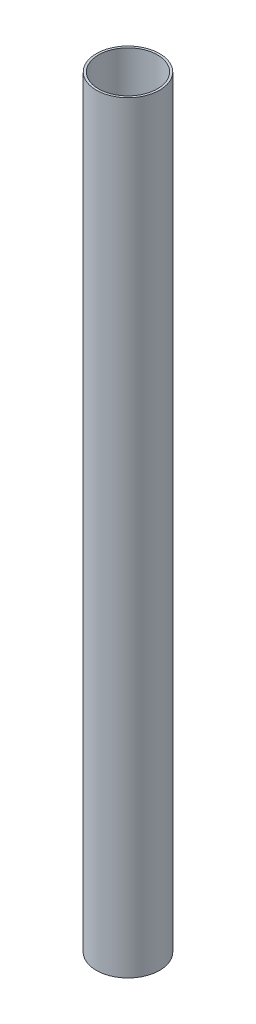
ISO-10303-21;
HEADER;
FILE_DESCRIPTION(('STEP AP214'),'2;1');
FILE_NAME('part.step','',(''),(''),'','','');
FILE_SCHEMA(('AUTOMOTIVE_DESIGN { 1 0 10303 214 1 1 1 1 }'));
ENDSEC;
DATA;
#1=APPLICATION_CONTEXT('core data for automotive mechanical design processes');
#2=APPLICATION_PROTOCOL_DEFINITION('international standard','automotive_design',2000,#1);
#3=PRODUCT_CONTEXT('',#1,'mechanical');
#4=PRODUCT('Part','Part','',(#3));
#5=PRODUCT_RELATED_PRODUCT_CATEGORY('part','',(#4));
#6=PRODUCT_DEFINITION_FORMATION('','',#4);
#7=PRODUCT_DEFINITION_CONTEXT('part definition',#1,'design');
#8=PRODUCT_DEFINITION('design','',#6,#7);
#9=PRODUCT_DEFINITION_SHAPE('','',#8);
#10=(LENGTH_UNIT() NAMED_UNIT(*) SI_UNIT(.MILLI.,.METRE.));
#11=(NAMED_UNIT(*) PLANE_ANGLE_UNIT() SI_UNIT($,.RADIAN.));
#12=(NAMED_UNIT(*) SI_UNIT($,.STERADIAN.) SOLID_ANGLE_UNIT());
#13=UNCERTAINTY_MEASURE_WITH_UNIT(LENGTH_MEASURE(1.E-05),#10,'distance_accuracy_value','');
#14=(GEOMETRIC_REPRESENTATION_CONTEXT(3) GLOBAL_UNCERTAINTY_ASSIGNED_CONTEXT((#13)) GLOBAL_UNIT_ASSIGNED_CONTEXT((#10,
#11,#12)) REPRESENTATION_CONTEXT('',''));
#15=CARTESIAN_POINT('',(0.,0.,0.));
#16=DIRECTION('',(0.,0.,1.));
#17=DIRECTION('',(1.,0.,0.));
#18=AXIS2_PLACEMENT_3D('',#15,#16,#17);
#19=CARTESIAN_POINT('',(0.,600.,0.));
#20=DIRECTION('',(0.,-1.,0.));
#21=DIRECTION('',(0.,0.,-1.));
#22=AXIS2_PLACEMENT_3D('',#19,#20,#21);
#23=CYLINDRICAL_SURFACE('',#22,19.);
#24=CARTESIAN_POINT('',(0.,600.,0.));
#25=DIRECTION('',(0.,1.,0.));
#26=DIRECTION('',(0.,0.,1.));
#27=AXIS2_PLACEMENT_3D('',#24,#25,#26);
#28=CIRCLE('',#27,19.);
#29=CARTESIAN_POINT('',(0.,600.,19.));
#30=VERTEX_POINT('',#29);
#31=EDGE_CURVE('E52',#30,#30,#28,.T.);
#32=ORIENTED_EDGE('',*,*,#31,.T.);
#33=EDGE_LOOP('',(#32));
#34=FACE_BOUND('',#33,.T.);
#35=CARTESIAN_POINT('',(0.,0.,0.));
#36=DIRECTION('',(0.,1.,0.));
#37=DIRECTION('',(0.,0.,1.));
#38=AXIS2_PLACEMENT_3D('',#35,#36,#37);
#39=CIRCLE('',#38,19.);
#40=CARTESIAN_POINT('',(0.,0.,19.));
#41=VERTEX_POINT('',#40);
#42=EDGE_CURVE('E58',#41,#41,#39,.T.);
#43=ORIENTED_EDGE('',*,*,#42,.F.);
#44=EDGE_LOOP('',(#43));
#45=FACE_BOUND('',#44,.T.);
#46=ADVANCED_FACE('F45',(#34,#45),#23,.F.);
#47=CARTESIAN_POINT('',(0.,600.,0.));
#48=DIRECTION('',(0.,-1.,0.));
#49=DIRECTION('',(0.,0.,-1.));
#50=AXIS2_PLACEMENT_3D('',#47,#48,#49);
#51=CYLINDRICAL_SURFACE('',#50,20.6);
#52=CARTESIAN_POINT('',(0.,600.,0.));
#53=DIRECTION('',(0.,1.,0.));
#54=DIRECTION('',(0.,0.,1.));
#55=AXIS2_PLACEMENT_3D('',#52,#53,#54);
#56=CIRCLE('',#55,20.6);
#57=CARTESIAN_POINT('',(0.,600.,20.6));
#58=VERTEX_POINT('',#57);
#59=EDGE_CURVE('E11',#58,#58,#56,.T.);
#60=ORIENTED_EDGE('',*,*,#59,.F.);
#61=EDGE_LOOP('',(#60));
#62=FACE_BOUND('',#61,.T.);
#63=CARTESIAN_POINT('',(0.,0.,0.));
#64=DIRECTION('',(0.,1.,0.));
#65=DIRECTION('',(0.,0.,1.));
#66=AXIS2_PLACEMENT_3D('',#63,#64,#65);
#67=CIRCLE('',#66,20.6);
#68=CARTESIAN_POINT('',(0.,0.,20.6));
#69=VERTEX_POINT('',#68);
#70=EDGE_CURVE('E48',#69,#69,#67,.T.);
#71=ORIENTED_EDGE('',*,*,#70,.T.);
#72=EDGE_LOOP('',(#71));
#73=FACE_BOUND('',#72,.T.);
#74=ADVANCED_FACE('F65',(#62,#73),#51,.T.);
#75=CARTESIAN_POINT('',(0.,600.,0.));
#76=DIRECTION('',(0.,1.,0.));
#77=DIRECTION('',(0.,0.,1.));
#78=AXIS2_PLACEMENT_3D('',#75,#76,#77);
#79=PLANE('',#78);
#80=ORIENTED_EDGE('',*,*,#31,.F.);
#81=EDGE_LOOP('',(#80));
#82=FACE_BOUND('',#81,.T.);
#83=ORIENTED_EDGE('',*,*,#59,.T.);
#84=EDGE_LOOP('',(#83));
#85=FACE_BOUND('',#84,.T.);
#86=ADVANCED_FACE('F69',(#82,#85),#79,.T.);
#87=CARTESIAN_POINT('',(0.,0.,0.));
#88=DIRECTION('',(0.,1.,0.));
#89=DIRECTION('',(0.,0.,1.));
#90=AXIS2_PLACEMENT_3D('',#87,#88,#89);
#91=PLANE('',#90);
#92=ORIENTED_EDGE('',*,*,#42,.T.);
#93=EDGE_LOOP('',(#92));
#94=FACE_BOUND('',#93,.T.);
#95=ORIENTED_EDGE('',*,*,#70,.F.);
#96=EDGE_LOOP('',(#95));
#97=FACE_BOUND('',#96,.T.);
#98=ADVANCED_FACE('F67',(#94,#97),#91,.F.);
#99=CLOSED_SHELL('',(#46,#74,#86,#98));
#100=MANIFOLD_SOLID_BREP('B2',#99);
#101=CARTESIAN_POINT('',(0.,700.,0.));
#102=DIRECTION('',(0.,-1.,0.));
#103=DIRECTION('',(0.,0.,-1.));
#104=AXIS2_PLACEMENT_3D('',#101,#102,#103);
#105=CYLINDRICAL_SURFACE('',#104,27.06751);
#106=CARTESIAN_POINT('',(0.,700.,0.));
#107=DIRECTION('',(0.,1.,0.));
#108=DIRECTION('',(0.,0.,1.));
#109=AXIS2_PLACEMENT_3D('',#106,#107,#108);
#110=CIRCLE('',#109,27.06751);
#111=CARTESIAN_POINT('',(0.,700.,27.06751));
#112=VERTEX_POINT('',#111);
#113=EDGE_CURVE('E130',#112,#112,#110,.T.);
#114=ORIENTED_EDGE('',*,*,#113,.T.);
#115=EDGE_LOOP('',(#114));
#116=FACE_BOUND('',#115,.T.);
#117=CARTESIAN_POINT('',(0.,0.,0.));
#118=DIRECTION('',(0.,1.,0.));
#119=DIRECTION('',(0.,0.,1.));
#120=AXIS2_PLACEMENT_3D('',#117,#118,#119);
#121=CIRCLE('',#120,27.06751);
#122=CARTESIAN_POINT('',(0.,0.,27.06751));
#123=VERTEX_POINT('',#122);
#124=EDGE_CURVE('E136',#123,#123,#121,.T.);
#125=ORIENTED_EDGE('',*,*,#124,.F.);
#126=EDGE_LOOP('',(#125));
#127=FACE_BOUND('',#126,.T.);
#128=ADVANCED_FACE('F123',(#116,#127),#105,.F.);
#129=CARTESIAN_POINT('',(0.,700.,0.));
#130=DIRECTION('',(0.,-1.,0.));
#131=DIRECTION('',(0.,0.,-1.));
#132=AXIS2_PLACEMENT_3D('',#129,#130,#131);
#133=CYLINDRICAL_SURFACE('',#132,29.083);
#134=CARTESIAN_POINT('',(0.,700.,0.));
#135=DIRECTION('',(0.,1.,0.));
#136=DIRECTION('',(0.,0.,1.));
#137=AXIS2_PLACEMENT_3D('',#134,#135,#136);
#138=CIRCLE('',#137,29.083);
#139=CARTESIAN_POINT('',(0.,700.,29.083));
#140=VERTEX_POINT('',#139);
#141=EDGE_CURVE('E44',#140,#140,#138,.T.);
#142=ORIENTED_EDGE('',*,*,#141,.F.);
#143=EDGE_LOOP('',(#142));
#144=FACE_BOUND('',#143,.T.);
#145=CARTESIAN_POINT('',(0.,0.,0.));
#146=DIRECTION('',(0.,1.,0.));
#147=DIRECTION('',(0.,0.,1.));
#148=AXIS2_PLACEMENT_3D('',#145,#146,#147);
#149=CIRCLE('',#148,29.083);
#150=CARTESIAN_POINT('',(0.,0.,29.083));
#151=VERTEX_POINT('',#150);
#152=EDGE_CURVE('E126',#151,#151,#149,.T.);
#153=ORIENTED_EDGE('',*,*,#152,.T.);
#154=EDGE_LOOP('',(#153));
#155=FACE_BOUND('',#154,.T.);
#156=ADVANCED_FACE('F143',(#144,#155),#133,.T.);
#157=CARTESIAN_POINT('',(0.,700.,0.));
#158=DIRECTION('',(0.,1.,0.));
#159=DIRECTION('',(0.,0.,1.));
#160=AXIS2_PLACEMENT_3D('',#157,#158,#159);
#161=PLANE('',#160);
#162=ORIENTED_EDGE('',*,*,#113,.F.);
#163=EDGE_LOOP('',(#162));
#164=FACE_BOUND('',#163,.T.);
#165=ORIENTED_EDGE('',*,*,#141,.T.);
#166=EDGE_LOOP('',(#165));
#167=FACE_BOUND('',#166,.T.);
#168=ADVANCED_FACE('F147',(#164,#167),#161,.T.);
#169=CARTESIAN_POINT('',(0.,0.,0.));
#170=DIRECTION('',(0.,1.,0.));
#171=DIRECTION('',(0.,0.,1.));
#172=AXIS2_PLACEMENT_3D('',#169,#170,#171);
#173=PLANE('',#172);
#174=ORIENTED_EDGE('',*,*,#124,.T.);
#175=EDGE_LOOP('',(#174));
#176=FACE_BOUND('',#175,.T.);
#177=ORIENTED_EDGE('',*,*,#152,.F.);
#178=EDGE_LOOP('',(#177));
#179=FACE_BOUND('',#178,.T.);
#180=ADVANCED_FACE('F145',(#176,#179),#173,.F.);
#181=CLOSED_SHELL('',(#128,#156,#168,#180));
#182=MANIFOLD_SOLID_BREP('B6',#181);
#183=ADVANCED_BREP_SHAPE_REPRESENTATION('',(#18,#100,#182),#14);
#184=SHAPE_DEFINITION_REPRESENTATION(#9,#183);
ENDSEC;
END-ISO-10303-21;
